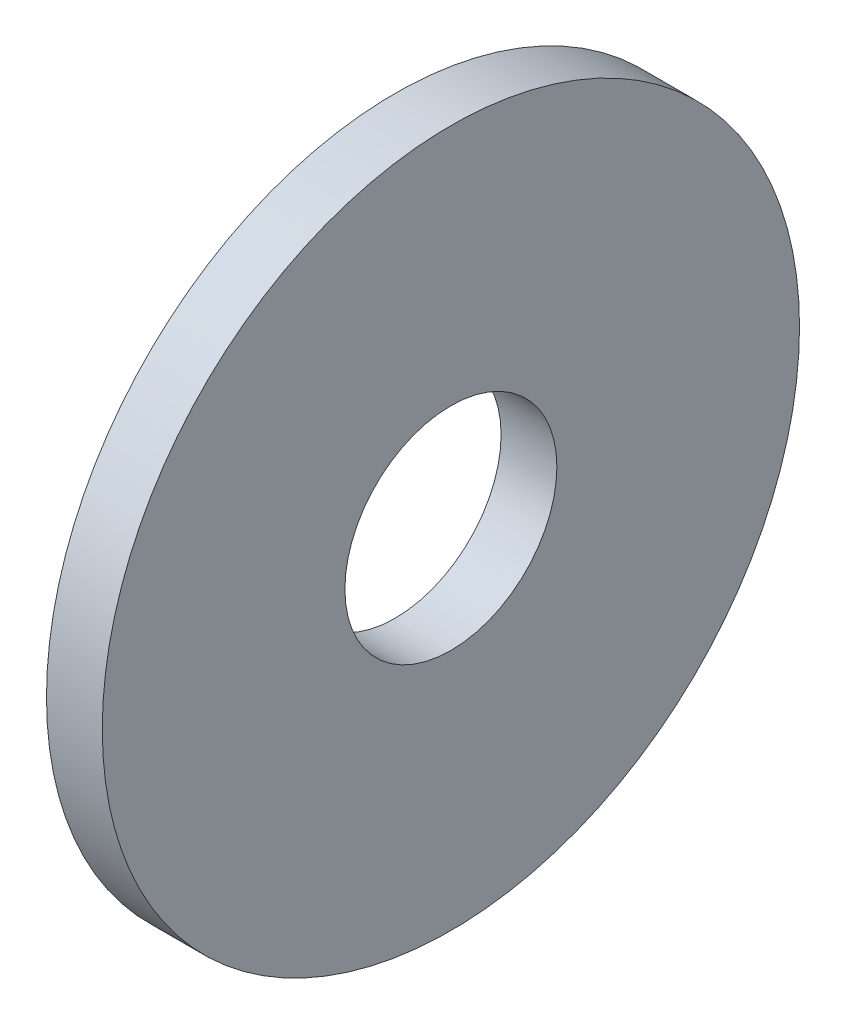
ISO-10303-21;
HEADER;
FILE_DESCRIPTION(('STEP AP214'),'2;1');
FILE_NAME('part.step','',(''),(''),'','','');
FILE_SCHEMA(('AUTOMOTIVE_DESIGN { 1 0 10303 214 1 1 1 1 }'));
ENDSEC;
DATA;
#1=APPLICATION_CONTEXT('core data for automotive mechanical design processes');
#2=APPLICATION_PROTOCOL_DEFINITION('international standard','automotive_design',2000,#1);
#3=PRODUCT_CONTEXT('',#1,'mechanical');
#4=PRODUCT('Part','Part','',(#3));
#5=PRODUCT_RELATED_PRODUCT_CATEGORY('part','',(#4));
#6=PRODUCT_DEFINITION_FORMATION('','',#4);
#7=PRODUCT_DEFINITION_CONTEXT('part definition',#1,'design');
#8=PRODUCT_DEFINITION('design','',#6,#7);
#9=PRODUCT_DEFINITION_SHAPE('','',#8);
#10=(LENGTH_UNIT() NAMED_UNIT(*) SI_UNIT(.MILLI.,.METRE.));
#11=(NAMED_UNIT(*) PLANE_ANGLE_UNIT() SI_UNIT($,.RADIAN.));
#12=(NAMED_UNIT(*) SI_UNIT($,.STERADIAN.) SOLID_ANGLE_UNIT());
#13=UNCERTAINTY_MEASURE_WITH_UNIT(LENGTH_MEASURE(1.E-05),#10,'distance_accuracy_value','');
#14=(GEOMETRIC_REPRESENTATION_CONTEXT(3) GLOBAL_UNCERTAINTY_ASSIGNED_CONTEXT((#13)) GLOBAL_UNIT_ASSIGNED_CONTEXT((#10,
#11,#12)) REPRESENTATION_CONTEXT('',''));
#15=CARTESIAN_POINT('',(0.,0.,0.));
#16=DIRECTION('',(0.,0.,1.));
#17=DIRECTION('',(1.,0.,0.));
#18=AXIS2_PLACEMENT_3D('',#15,#16,#17);
#19=CARTESIAN_POINT('',(1.778,11.1125,0.));
#20=DIRECTION('',(1.,0.,0.));
#21=DIRECTION('',(0.,0.,-1.));
#22=AXIS2_PLACEMENT_3D('',#19,#20,#21);
#23=PLANE('',#22);
#24=CARTESIAN_POINT('',(1.778,0.,0.));
#25=DIRECTION('',(-1.,0.,0.));
#26=DIRECTION('',(0.,0.,1.));
#27=AXIS2_PLACEMENT_3D('',#24,#25,#26);
#28=CIRCLE('',#27,3.3782);
#29=CARTESIAN_POINT('',(1.778,0.,3.3782));
#30=VERTEX_POINT('',#29);
#31=EDGE_CURVE('E10',#30,#30,#28,.T.);
#32=ORIENTED_EDGE('',*,*,#31,.T.);
#33=EDGE_LOOP('',(#32));
#34=FACE_BOUND('',#33,.T.);
#35=CARTESIAN_POINT('',(1.778,0.,0.));
#36=DIRECTION('',(-1.,0.,0.));
#37=DIRECTION('',(0.,0.,1.));
#38=AXIS2_PLACEMENT_3D('',#35,#36,#37);
#39=CIRCLE('',#38,11.1125);
#40=CARTESIAN_POINT('',(1.778,0.,11.1125));
#41=VERTEX_POINT('',#40);
#42=EDGE_CURVE('E44',#41,#41,#39,.T.);
#43=ORIENTED_EDGE('',*,*,#42,.F.);
#44=EDGE_LOOP('',(#43));
#45=FACE_BOUND('',#44,.T.);
#46=ADVANCED_FACE('F30',(#34,#45),#23,.T.);
#47=CARTESIAN_POINT('',(1.778,0.,0.));
#48=DIRECTION('',(-1.,0.,0.));
#49=DIRECTION('',(0.,0.,1.));
#50=AXIS2_PLACEMENT_3D('',#47,#48,#49);
#51=CYLINDRICAL_SURFACE('',#50,3.3782);
#52=CARTESIAN_POINT('',(0.,0.,0.));
#53=DIRECTION('',(-1.,0.,0.));
#54=DIRECTION('',(0.,0.,1.));
#55=AXIS2_PLACEMENT_3D('',#52,#53,#54);
#56=CIRCLE('',#55,3.3782);
#57=CARTESIAN_POINT('',(0.,0.,3.3782));
#58=VERTEX_POINT('',#57);
#59=EDGE_CURVE('E36',#58,#58,#56,.T.);
#60=ORIENTED_EDGE('',*,*,#59,.T.);
#61=EDGE_LOOP('',(#60));
#62=FACE_BOUND('',#61,.T.);
#63=ORIENTED_EDGE('',*,*,#31,.F.);
#64=EDGE_LOOP('',(#63));
#65=FACE_BOUND('',#64,.T.);
#66=ADVANCED_FACE('F54',(#62,#65),#51,.F.);
#67=CARTESIAN_POINT('',(0.,3.3782,0.));
#68=DIRECTION('',(-1.,0.,0.));
#69=DIRECTION('',(0.,0.,1.));
#70=AXIS2_PLACEMENT_3D('',#67,#68,#69);
#71=PLANE('',#70);
#72=CARTESIAN_POINT('',(0.,0.,0.));
#73=DIRECTION('',(-1.,0.,0.));
#74=DIRECTION('',(0.,0.,1.));
#75=AXIS2_PLACEMENT_3D('',#72,#73,#74);
#76=CIRCLE('',#75,11.1125);
#77=CARTESIAN_POINT('',(0.,0.,11.1125));
#78=VERTEX_POINT('',#77);
#79=EDGE_CURVE('E40',#78,#78,#76,.T.);
#80=ORIENTED_EDGE('',*,*,#79,.T.);
#81=EDGE_LOOP('',(#80));
#82=FACE_BOUND('',#81,.T.);
#83=ORIENTED_EDGE('',*,*,#59,.F.);
#84=EDGE_LOOP('',(#83));
#85=FACE_BOUND('',#84,.T.);
#86=ADVANCED_FACE('F58',(#82,#85),#71,.T.);
#87=CARTESIAN_POINT('',(1.778,0.,0.));
#88=DIRECTION('',(-1.,0.,0.));
#89=DIRECTION('',(0.,0.,1.));
#90=AXIS2_PLACEMENT_3D('',#87,#88,#89);
#91=CYLINDRICAL_SURFACE('',#90,11.1125);
#92=ORIENTED_EDGE('',*,*,#42,.T.);
#93=EDGE_LOOP('',(#92));
#94=FACE_BOUND('',#93,.T.);
#95=ORIENTED_EDGE('',*,*,#79,.F.);
#96=EDGE_LOOP('',(#95));
#97=FACE_BOUND('',#96,.T.);
#98=ADVANCED_FACE('F50',(#94,#97),#91,.T.);
#99=CLOSED_SHELL('',(#46,#66,#86,#98));
#100=MANIFOLD_SOLID_BREP('B2',#99);
#101=ADVANCED_BREP_SHAPE_REPRESENTATION('',(#18,#100),#14);
#102=SHAPE_DEFINITION_REPRESENTATION(#9,#101);
ENDSEC;
END-ISO-10303-21;
